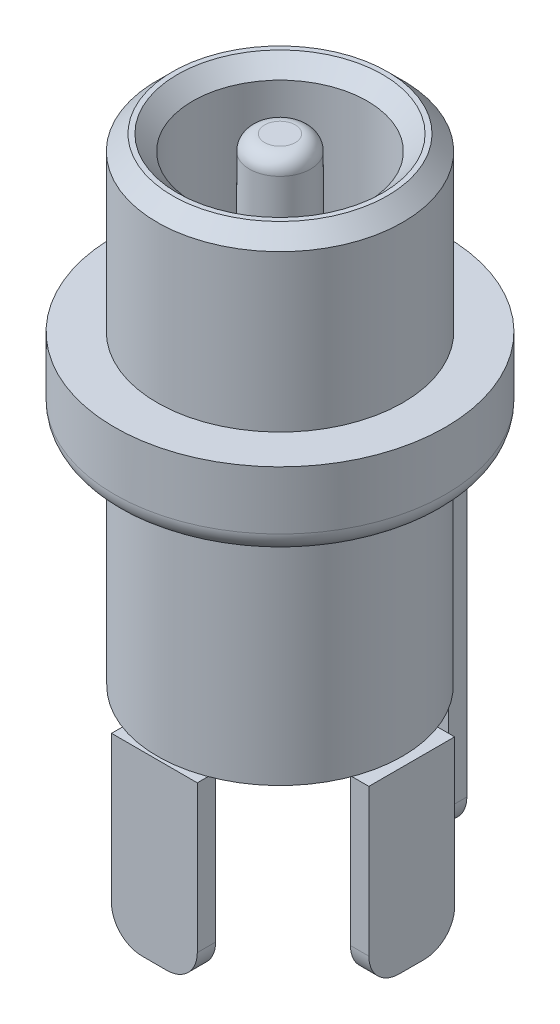
ISO-10303-21;
HEADER;
FILE_DESCRIPTION(('STEP AP214'),'2;1');
FILE_NAME('part.step','',(''),(''),'','','');
FILE_SCHEMA(('AUTOMOTIVE_DESIGN { 1 0 10303 214 1 1 1 1 }'));
ENDSEC;
DATA;
#1=APPLICATION_CONTEXT('core data for automotive mechanical design processes');
#2=APPLICATION_PROTOCOL_DEFINITION('international standard','automotive_design',2000,#1);
#3=PRODUCT_CONTEXT('',#1,'mechanical');
#4=PRODUCT('Part','Part','',(#3));
#5=PRODUCT_RELATED_PRODUCT_CATEGORY('part','',(#4));
#6=PRODUCT_DEFINITION_FORMATION('','',#4);
#7=PRODUCT_DEFINITION_CONTEXT('part definition',#1,'design');
#8=PRODUCT_DEFINITION('design','',#6,#7);
#9=PRODUCT_DEFINITION_SHAPE('','',#8);
#10=(LENGTH_UNIT() NAMED_UNIT(*) SI_UNIT(.MILLI.,.METRE.));
#11=(NAMED_UNIT(*) PLANE_ANGLE_UNIT() SI_UNIT($,.RADIAN.));
#12=(NAMED_UNIT(*) SI_UNIT($,.STERADIAN.) SOLID_ANGLE_UNIT());
#13=UNCERTAINTY_MEASURE_WITH_UNIT(LENGTH_MEASURE(1.E-05),#10,'distance_accuracy_value','');
#14=(GEOMETRIC_REPRESENTATION_CONTEXT(3) GLOBAL_UNCERTAINTY_ASSIGNED_CONTEXT((#13)) GLOBAL_UNIT_ASSIGNED_CONTEXT((#10,
#11,#12)) REPRESENTATION_CONTEXT('',''));
#15=CARTESIAN_POINT('',(0.,0.,0.));
#16=DIRECTION('',(0.,0.,1.));
#17=DIRECTION('',(1.,0.,0.));
#18=AXIS2_PLACEMENT_3D('',#15,#16,#17);
#19=CARTESIAN_POINT('',(4.3,-5.8,1.4));
#20=DIRECTION('',(-1.,0.,0.));
#21=DIRECTION('',(0.,-1.,0.));
#22=AXIS2_PLACEMENT_3D('',#19,#20,#21);
#23=PLANE('',#22);
#24=DIRECTION('',(0.,1.,0.));
#25=VECTOR('',#24,1.);
#26=CARTESIAN_POINT('',(4.3,-5.8,1.4));
#27=LINE('',#26,#25);
#28=CARTESIAN_POINT('',(4.3,-4.8,1.4));
#29=VERTEX_POINT('',#28);
#30=CARTESIAN_POINT('',(4.3,0.,1.4));
#31=VERTEX_POINT('',#30);
#32=EDGE_CURVE('E102',#29,#31,#27,.T.);
#33=ORIENTED_EDGE('',*,*,#32,.F.);
#34=CARTESIAN_POINT('',(4.3,-4.8,0.4));
#35=DIRECTION('',(-1.,0.,0.));
#36=DIRECTION('',(0.,-1.,0.));
#37=AXIS2_PLACEMENT_3D('',#34,#35,#36);
#38=CIRCLE('',#37,1.);
#39=CARTESIAN_POINT('',(4.3,-5.8,0.4));
#40=VERTEX_POINT('',#39);
#41=EDGE_CURVE('E59',#29,#40,#38,.F.);
#42=ORIENTED_EDGE('',*,*,#41,.T.);
#43=DIRECTION('',(0.,0.,1.));
#44=VECTOR('',#43,1.);
#45=CARTESIAN_POINT('',(4.3,-5.8,1.4));
#46=LINE('',#45,#44);
#47=CARTESIAN_POINT('',(4.3,-5.8,-0.4));
#48=VERTEX_POINT('',#47);
#49=EDGE_CURVE('E130',#48,#40,#46,.T.);
#50=ORIENTED_EDGE('',*,*,#49,.F.);
#51=CARTESIAN_POINT('',(4.3,-4.8,-0.4));
#52=DIRECTION('',(-1.,0.,0.));
#53=DIRECTION('',(0.,-1.,0.));
#54=AXIS2_PLACEMENT_3D('',#51,#52,#53);
#55=CIRCLE('',#54,1.);
#56=CARTESIAN_POINT('',(4.3,-4.8,-1.4));
#57=VERTEX_POINT('',#56);
#58=EDGE_CURVE('E66',#48,#57,#55,.F.);
#59=ORIENTED_EDGE('',*,*,#58,.T.);
#60=DIRECTION('',(0.,1.,0.));
#61=VECTOR('',#60,1.);
#62=CARTESIAN_POINT('',(4.3,-5.8,-1.4));
#63=LINE('',#62,#61);
#64=CARTESIAN_POINT('',(4.3,0.,-1.4));
#65=VERTEX_POINT('',#64);
#66=EDGE_CURVE('E120',#57,#65,#63,.T.);
#67=ORIENTED_EDGE('',*,*,#66,.T.);
#68=DIRECTION('',(0.,0.,1.));
#69=VECTOR('',#68,1.);
#70=CARTESIAN_POINT('',(4.3,0.,1.4));
#71=LINE('',#70,#69);
#72=EDGE_CURVE('E116',#65,#31,#71,.T.);
#73=ORIENTED_EDGE('',*,*,#72,.T.);
#74=EDGE_LOOP('',(#33,#42,#50,#59,#67,#73));
#75=FACE_BOUND('',#74,.T.);
#76=ADVANCED_FACE('F51',(#75),#23,.F.);
#77=CARTESIAN_POINT('',(3.7,-5.8,1.4));
#78=DIRECTION('',(0.,0.,-1.));
#79=DIRECTION('',(-1.,0.,0.));
#80=AXIS2_PLACEMENT_3D('',#77,#78,#79);
#81=PLANE('',#80);
#82=DIRECTION('',(0.,1.,0.));
#83=VECTOR('',#82,1.);
#84=CARTESIAN_POINT('',(3.7,-5.8,1.4));
#85=LINE('',#84,#83);
#86=CARTESIAN_POINT('',(3.7,-4.8,1.4));
#87=VERTEX_POINT('',#86);
#88=CARTESIAN_POINT('',(3.7,0.,1.4));
#89=VERTEX_POINT('',#88);
#90=EDGE_CURVE('E110',#87,#89,#85,.T.);
#91=ORIENTED_EDGE('',*,*,#90,.F.);
#92=DIRECTION('',(-1.,0.,0.));
#93=VECTOR('',#92,1.);
#94=CARTESIAN_POINT('',(4.3,-4.8,1.4));
#95=LINE('',#94,#93);
#96=EDGE_CURVE('E74',#87,#29,#95,.F.);
#97=ORIENTED_EDGE('',*,*,#96,.T.);
#98=ORIENTED_EDGE('',*,*,#32,.T.);
#99=DIRECTION('',(-1.,0.,0.));
#100=VECTOR('',#99,1.);
#101=CARTESIAN_POINT('',(3.7,0.,1.4));
#102=LINE('',#101,#100);
#103=EDGE_CURVE('E105',#31,#89,#102,.T.);
#104=ORIENTED_EDGE('',*,*,#103,.T.);
#105=EDGE_LOOP('',(#91,#97,#98,#104));
#106=FACE_BOUND('',#105,.T.);
#107=ADVANCED_FACE('F104',(#106),#81,.F.);
#108=CARTESIAN_POINT('',(3.7,-5.8,1.4));
#109=DIRECTION('',(1.,0.,0.));
#110=DIRECTION('',(0.,0.,-1.));
#111=AXIS2_PLACEMENT_3D('',#108,#109,#110);
#112=PLANE('',#111);
#113=DIRECTION('',(0.,0.,-1.));
#114=VECTOR('',#113,1.);
#115=CARTESIAN_POINT('',(3.7,-5.8,1.4));
#116=LINE('',#115,#114);
#117=CARTESIAN_POINT('',(3.7,-5.8,0.4));
#118=VERTEX_POINT('',#117);
#119=CARTESIAN_POINT('',(3.7,-5.8,-0.4));
#120=VERTEX_POINT('',#119);
#121=EDGE_CURVE('E124',#118,#120,#116,.T.);
#122=ORIENTED_EDGE('',*,*,#121,.F.);
#123=CARTESIAN_POINT('',(3.7,-4.8,0.4));
#124=DIRECTION('',(1.,0.,0.));
#125=DIRECTION('',(0.,0.,-1.));
#126=AXIS2_PLACEMENT_3D('',#123,#124,#125);
#127=CIRCLE('',#126,1.);
#128=EDGE_CURVE('E142',#118,#87,#127,.F.);
#129=ORIENTED_EDGE('',*,*,#128,.T.);
#130=ORIENTED_EDGE('',*,*,#90,.T.);
#131=DIRECTION('',(0.,0.,-1.));
#132=VECTOR('',#131,1.);
#133=CARTESIAN_POINT('',(3.7,0.,1.4));
#134=LINE('',#133,#132);
#135=CARTESIAN_POINT('',(3.7,0.,-1.4));
#136=VERTEX_POINT('',#135);
#137=EDGE_CURVE('E118',#89,#136,#134,.T.);
#138=ORIENTED_EDGE('',*,*,#137,.T.);
#139=DIRECTION('',(0.,1.,0.));
#140=VECTOR('',#139,1.);
#141=CARTESIAN_POINT('',(3.7,-5.8,-1.4));
#142=LINE('',#141,#140);
#143=CARTESIAN_POINT('',(3.7,-4.8,-1.4));
#144=VERTEX_POINT('',#143);
#145=EDGE_CURVE('E132',#144,#136,#142,.T.);
#146=ORIENTED_EDGE('',*,*,#145,.F.);
#147=CARTESIAN_POINT('',(3.7,-4.8,-0.4));
#148=DIRECTION('',(1.,0.,0.));
#149=DIRECTION('',(0.,0.,-1.));
#150=AXIS2_PLACEMENT_3D('',#147,#148,#149);
#151=CIRCLE('',#150,1.);
#152=EDGE_CURVE('E140',#144,#120,#151,.F.);
#153=ORIENTED_EDGE('',*,*,#152,.T.);
#154=EDGE_LOOP('',(#122,#129,#130,#138,#146,#153));
#155=FACE_BOUND('',#154,.T.);
#156=ADVANCED_FACE('F155',(#155),#112,.F.);
#157=CARTESIAN_POINT('',(3.7,-5.8,-1.4));
#158=DIRECTION('',(0.,0.,1.));
#159=DIRECTION('',(1.,0.,0.));
#160=AXIS2_PLACEMENT_3D('',#157,#158,#159);
#161=PLANE('',#160);
#162=ORIENTED_EDGE('',*,*,#66,.F.);
#163=DIRECTION('',(1.,0.,0.));
#164=VECTOR('',#163,1.);
#165=CARTESIAN_POINT('',(3.7,-4.8,-1.4));
#166=LINE('',#165,#164);
#167=EDGE_CURVE('E12',#57,#144,#166,.F.);
#168=ORIENTED_EDGE('',*,*,#167,.T.);
#169=ORIENTED_EDGE('',*,*,#145,.T.);
#170=DIRECTION('',(1.,0.,0.));
#171=VECTOR('',#170,1.);
#172=CARTESIAN_POINT('',(3.7,0.,-1.4));
#173=LINE('',#172,#171);
#174=EDGE_CURVE('E128',#136,#65,#173,.T.);
#175=ORIENTED_EDGE('',*,*,#174,.T.);
#176=EDGE_LOOP('',(#162,#168,#169,#175));
#177=FACE_BOUND('',#176,.T.);
#178=ADVANCED_FACE('F161',(#177),#161,.F.);
#179=CARTESIAN_POINT('',(0.,-5.8,0.));
#180=DIRECTION('',(0.,-1.,0.));
#181=DIRECTION('',(1.,0.,0.));
#182=AXIS2_PLACEMENT_3D('',#179,#180,#181);
#183=PLANE('',#182);
#184=ORIENTED_EDGE('',*,*,#49,.T.);
#185=DIRECTION('',(-1.,0.,0.));
#186=VECTOR('',#185,1.);
#187=CARTESIAN_POINT('',(3.7,-5.8,0.4));
#188=LINE('',#187,#186);
#189=EDGE_CURVE('E137',#40,#118,#188,.T.);
#190=ORIENTED_EDGE('',*,*,#189,.T.);
#191=ORIENTED_EDGE('',*,*,#121,.T.);
#192=DIRECTION('',(1.,0.,0.));
#193=VECTOR('',#192,1.);
#194=CARTESIAN_POINT('',(4.3,-5.8,-0.4));
#195=LINE('',#194,#193);
#196=EDGE_CURVE('E109',#120,#48,#195,.T.);
#197=ORIENTED_EDGE('',*,*,#196,.T.);
#198=EDGE_LOOP('',(#184,#190,#191,#197));
#199=FACE_BOUND('',#198,.T.);
#200=ADVANCED_FACE('F149',(#199),#183,.T.);
#201=CARTESIAN_POINT('',(0.,0.,0.));
#202=DIRECTION('',(0.,-1.,0.));
#203=DIRECTION('',(1.,0.,0.));
#204=AXIS2_PLACEMENT_3D('',#201,#202,#203);
#205=PLANE('',#204);
#206=ORIENTED_EDGE('',*,*,#72,.F.);
#207=ORIENTED_EDGE('',*,*,#174,.F.);
#208=ORIENTED_EDGE('',*,*,#137,.F.);
#209=ORIENTED_EDGE('',*,*,#103,.F.);
#210=EDGE_LOOP('',(#206,#207,#208,#209));
#211=FACE_BOUND('',#210,.T.);
#212=ADVANCED_FACE('F114',(#211),#205,.F.);
#213=CARTESIAN_POINT('',(0.,-4.8,0.399999999999999));
#214=DIRECTION('',(1.,0.,0.));
#215=DIRECTION('',(0.,0.,-1.));
#216=AXIS2_PLACEMENT_3D('',#213,#214,#215);
#217=CYLINDRICAL_SURFACE('',#216,1.);
#218=ORIENTED_EDGE('',*,*,#41,.F.);
#219=ORIENTED_EDGE('',*,*,#96,.F.);
#220=ORIENTED_EDGE('',*,*,#128,.F.);
#221=ORIENTED_EDGE('',*,*,#189,.F.);
#222=EDGE_LOOP('',(#218,#219,#220,#221));
#223=FACE_BOUND('',#222,.T.);
#224=ADVANCED_FACE('F153',(#223),#217,.T.);
#225=CARTESIAN_POINT('',(0.,-4.8,-0.4));
#226=DIRECTION('',(-1.,0.,0.));
#227=DIRECTION('',(0.,-1.,0.));
#228=AXIS2_PLACEMENT_3D('',#225,#226,#227);
#229=CYLINDRICAL_SURFACE('',#228,1.);
#230=ORIENTED_EDGE('',*,*,#152,.F.);
#231=ORIENTED_EDGE('',*,*,#167,.F.);
#232=ORIENTED_EDGE('',*,*,#58,.F.);
#233=ORIENTED_EDGE('',*,*,#196,.F.);
#234=EDGE_LOOP('',(#230,#231,#232,#233));
#235=FACE_BOUND('',#234,.T.);
#236=ADVANCED_FACE('F53',(#235),#229,.T.);
#237=CLOSED_SHELL('',(#76,#107,#156,#178,#200,#212,#224,#236));
#238=MANIFOLD_SOLID_BREP('B2',#237);
#239=CARTESIAN_POINT('',(1.4,-5.8,4.1));
#240=DIRECTION('',(-1.,0.,0.));
#241=DIRECTION('',(0.,-1.,0.));
#242=AXIS2_PLACEMENT_3D('',#239,#240,#241);
#243=PLANE('',#242);
#244=DIRECTION('',(0.,1.,0.));
#245=VECTOR('',#244,1.);
#246=CARTESIAN_POINT('',(1.4,-5.8,4.1));
#247=LINE('',#246,#245);
#248=CARTESIAN_POINT('',(1.4,-4.8,4.1));
#249=VERTEX_POINT('',#248);
#250=CARTESIAN_POINT('',(1.4,0.,4.1));
#251=VERTEX_POINT('',#250);
#252=EDGE_CURVE('E285',#249,#251,#247,.T.);
#253=ORIENTED_EDGE('',*,*,#252,.F.);
#254=DIRECTION('',(0.,0.,1.));
#255=VECTOR('',#254,1.);
#256=CARTESIAN_POINT('',(1.4,-4.8,3.5));
#257=LINE('',#256,#255);
#258=CARTESIAN_POINT('',(1.4,-4.8,3.5));
#259=VERTEX_POINT('',#258);
#260=EDGE_CURVE('E49',#249,#259,#257,.F.);
#261=ORIENTED_EDGE('',*,*,#260,.T.);
#262=DIRECTION('',(0.,1.,0.));
#263=VECTOR('',#262,1.);
#264=CARTESIAN_POINT('',(1.4,-5.8,3.5));
#265=LINE('',#264,#263);
#266=CARTESIAN_POINT('',(1.4,0.,3.5));
#267=VERTEX_POINT('',#266);
#268=EDGE_CURVE('E305',#259,#267,#265,.T.);
#269=ORIENTED_EDGE('',*,*,#268,.T.);
#270=DIRECTION('',(0.,0.,1.));
#271=VECTOR('',#270,1.);
#272=CARTESIAN_POINT('',(1.4,0.,4.1));
#273=LINE('',#272,#271);
#274=EDGE_CURVE('E300',#267,#251,#273,.T.);
#275=ORIENTED_EDGE('',*,*,#274,.T.);
#276=EDGE_LOOP('',(#253,#261,#269,#275));
#277=FACE_BOUND('',#276,.T.);
#278=ADVANCED_FACE('F234',(#277),#243,.F.);
#279=CARTESIAN_POINT('',(-1.4,-5.8,4.1));
#280=DIRECTION('',(0.,0.,-1.));
#281=DIRECTION('',(-1.,0.,0.));
#282=AXIS2_PLACEMENT_3D('',#279,#280,#281);
#283=PLANE('',#282);
#284=DIRECTION('',(0.,1.,0.));
#285=VECTOR('',#284,1.);
#286=CARTESIAN_POINT('',(-1.4,-5.8,4.1));
#287=LINE('',#286,#285);
#288=CARTESIAN_POINT('',(-1.4,-4.8,4.1));
#289=VERTEX_POINT('',#288);
#290=CARTESIAN_POINT('',(-1.4,0.,4.1));
#291=VERTEX_POINT('',#290);
#292=EDGE_CURVE('E294',#289,#291,#287,.T.);
#293=ORIENTED_EDGE('',*,*,#292,.F.);
#294=CARTESIAN_POINT('',(-0.4,-4.8,4.1));
#295=DIRECTION('',(0.,0.,-1.));
#296=DIRECTION('',(-1.,0.,0.));
#297=AXIS2_PLACEMENT_3D('',#294,#295,#296);
#298=CIRCLE('',#297,1.);
#299=CARTESIAN_POINT('',(-0.4,-5.8,4.1));
#300=VERTEX_POINT('',#299);
#301=EDGE_CURVE('E242',#289,#300,#298,.F.);
#302=ORIENTED_EDGE('',*,*,#301,.T.);
#303=DIRECTION('',(-1.,0.,0.));
#304=VECTOR('',#303,1.);
#305=CARTESIAN_POINT('',(-1.4,-5.8,4.1));
#306=LINE('',#305,#304);
#307=CARTESIAN_POINT('',(0.4,-5.8,4.1));
#308=VERTEX_POINT('',#307);
#309=EDGE_CURVE('E315',#308,#300,#306,.T.);
#310=ORIENTED_EDGE('',*,*,#309,.F.);
#311=CARTESIAN_POINT('',(0.4,-4.8,4.1));
#312=DIRECTION('',(0.,0.,-1.));
#313=DIRECTION('',(-1.,0.,0.));
#314=AXIS2_PLACEMENT_3D('',#311,#312,#313);
#315=CIRCLE('',#314,1.);
#316=EDGE_CURVE('E249',#308,#249,#315,.F.);
#317=ORIENTED_EDGE('',*,*,#316,.T.);
#318=ORIENTED_EDGE('',*,*,#252,.T.);
#319=DIRECTION('',(-1.,0.,0.));
#320=VECTOR('',#319,1.);
#321=CARTESIAN_POINT('',(-1.4,0.,4.1));
#322=LINE('',#321,#320);
#323=EDGE_CURVE('E288',#251,#291,#322,.T.);
#324=ORIENTED_EDGE('',*,*,#323,.T.);
#325=EDGE_LOOP('',(#293,#302,#310,#317,#318,#324));
#326=FACE_BOUND('',#325,.T.);
#327=ADVANCED_FACE('F287',(#326),#283,.F.);
#328=CARTESIAN_POINT('',(-1.4,-5.8,4.1));
#329=DIRECTION('',(1.,0.,0.));
#330=DIRECTION('',(0.,1.,0.));
#331=AXIS2_PLACEMENT_3D('',#328,#329,#330);
#332=PLANE('',#331);
#333=DIRECTION('',(0.,1.,0.));
#334=VECTOR('',#333,1.);
#335=CARTESIAN_POINT('',(-1.4,-5.8,3.5));
#336=LINE('',#335,#334);
#337=CARTESIAN_POINT('',(-1.4,-4.8,3.5));
#338=VERTEX_POINT('',#337);
#339=CARTESIAN_POINT('',(-1.4,0.,3.5));
#340=VERTEX_POINT('',#339);
#341=EDGE_CURVE('E317',#338,#340,#336,.T.);
#342=ORIENTED_EDGE('',*,*,#341,.F.);
#343=DIRECTION('',(0.,0.,-1.));
#344=VECTOR('',#343,1.);
#345=CARTESIAN_POINT('',(-1.4,-4.8,4.1));
#346=LINE('',#345,#344);
#347=EDGE_CURVE('E257',#338,#289,#346,.F.);
#348=ORIENTED_EDGE('',*,*,#347,.T.);
#349=ORIENTED_EDGE('',*,*,#292,.T.);
#350=DIRECTION('',(0.,0.,-1.));
#351=VECTOR('',#350,1.);
#352=CARTESIAN_POINT('',(-1.4,0.,4.1));
#353=LINE('',#352,#351);
#354=EDGE_CURVE('E302',#291,#340,#353,.T.);
#355=ORIENTED_EDGE('',*,*,#354,.T.);
#356=EDGE_LOOP('',(#342,#348,#349,#355));
#357=FACE_BOUND('',#356,.T.);
#358=ADVANCED_FACE('F342',(#357),#332,.F.);
#359=CARTESIAN_POINT('',(-1.4,-5.8,3.5));
#360=DIRECTION('',(0.,0.,1.));
#361=DIRECTION('',(1.,0.,0.));
#362=AXIS2_PLACEMENT_3D('',#359,#360,#361);
#363=PLANE('',#362);
#364=DIRECTION('',(1.,0.,0.));
#365=VECTOR('',#364,1.);
#366=CARTESIAN_POINT('',(-1.4,-5.8,3.5));
#367=LINE('',#366,#365);
#368=CARTESIAN_POINT('',(-0.4,-5.8,3.5));
#369=VERTEX_POINT('',#368);
#370=CARTESIAN_POINT('',(0.4,-5.8,3.5));
#371=VERTEX_POINT('',#370);
#372=EDGE_CURVE('E309',#369,#371,#367,.T.);
#373=ORIENTED_EDGE('',*,*,#372,.F.);
#374=CARTESIAN_POINT('',(-0.4,-4.8,3.5));
#375=DIRECTION('',(0.,0.,1.));
#376=DIRECTION('',(1.,0.,0.));
#377=AXIS2_PLACEMENT_3D('',#374,#375,#376);
#378=CIRCLE('',#377,1.);
#379=EDGE_CURVE('E327',#369,#338,#378,.F.);
#380=ORIENTED_EDGE('',*,*,#379,.T.);
#381=ORIENTED_EDGE('',*,*,#341,.T.);
#382=DIRECTION('',(1.,0.,0.));
#383=VECTOR('',#382,1.);
#384=CARTESIAN_POINT('',(-1.4,0.,3.5));
#385=LINE('',#384,#383);
#386=EDGE_CURVE('E313',#340,#267,#385,.T.);
#387=ORIENTED_EDGE('',*,*,#386,.T.);
#388=ORIENTED_EDGE('',*,*,#268,.F.);
#389=CARTESIAN_POINT('',(0.4,-4.8,3.5));
#390=DIRECTION('',(0.,0.,1.));
#391=DIRECTION('',(1.,0.,0.));
#392=AXIS2_PLACEMENT_3D('',#389,#390,#391);
#393=CIRCLE('',#392,1.);
#394=EDGE_CURVE('E325',#259,#371,#393,.F.);
#395=ORIENTED_EDGE('',*,*,#394,.T.);
#396=EDGE_LOOP('',(#373,#380,#381,#387,#388,#395));
#397=FACE_BOUND('',#396,.T.);
#398=ADVANCED_FACE('F341',(#397),#363,.F.);
#399=CARTESIAN_POINT('',(0.,-5.8,0.));
#400=DIRECTION('',(0.,-1.,0.));
#401=DIRECTION('',(1.,0.,0.));
#402=AXIS2_PLACEMENT_3D('',#399,#400,#401);
#403=PLANE('',#402);
#404=ORIENTED_EDGE('',*,*,#309,.T.);
#405=DIRECTION('',(0.,0.,-1.));
#406=VECTOR('',#405,1.);
#407=CARTESIAN_POINT('',(-0.4,-5.8,3.5));
#408=LINE('',#407,#406);
#409=EDGE_CURVE('E322',#300,#369,#408,.T.);
#410=ORIENTED_EDGE('',*,*,#409,.T.);
#411=ORIENTED_EDGE('',*,*,#372,.T.);
#412=DIRECTION('',(0.,0.,1.));
#413=VECTOR('',#412,1.);
#414=CARTESIAN_POINT('',(0.4,-5.8,4.1));
#415=LINE('',#414,#413);
#416=EDGE_CURVE('E293',#371,#308,#415,.T.);
#417=ORIENTED_EDGE('',*,*,#416,.T.);
#418=EDGE_LOOP('',(#404,#410,#411,#417));
#419=FACE_BOUND('',#418,.T.);
#420=ADVANCED_FACE('F335',(#419),#403,.T.);
#421=CARTESIAN_POINT('',(0.,0.,0.));
#422=DIRECTION('',(0.,-1.,0.));
#423=DIRECTION('',(1.,0.,0.));
#424=AXIS2_PLACEMENT_3D('',#421,#422,#423);
#425=PLANE('',#424);
#426=ORIENTED_EDGE('',*,*,#274,.F.);
#427=ORIENTED_EDGE('',*,*,#386,.F.);
#428=ORIENTED_EDGE('',*,*,#354,.F.);
#429=ORIENTED_EDGE('',*,*,#323,.F.);
#430=EDGE_LOOP('',(#426,#427,#428,#429));
#431=FACE_BOUND('',#430,.T.);
#432=ADVANCED_FACE('F298',(#431),#425,.F.);
#433=CARTESIAN_POINT('',(-0.4,-4.8,0.));
#434=DIRECTION('',(0.,0.,1.));
#435=DIRECTION('',(1.,0.,0.));
#436=AXIS2_PLACEMENT_3D('',#433,#434,#435);
#437=CYLINDRICAL_SURFACE('',#436,1.);
#438=ORIENTED_EDGE('',*,*,#301,.F.);
#439=ORIENTED_EDGE('',*,*,#347,.F.);
#440=ORIENTED_EDGE('',*,*,#379,.F.);
#441=ORIENTED_EDGE('',*,*,#409,.F.);
#442=EDGE_LOOP('',(#438,#439,#440,#441));
#443=FACE_BOUND('',#442,.T.);
#444=ADVANCED_FACE('F339',(#443),#437,.T.);
#445=CARTESIAN_POINT('',(0.4,-4.8,0.));
#446=DIRECTION('',(0.,0.,-1.));
#447=DIRECTION('',(-1.,0.,0.));
#448=AXIS2_PLACEMENT_3D('',#445,#446,#447);
#449=CYLINDRICAL_SURFACE('',#448,1.);
#450=ORIENTED_EDGE('',*,*,#394,.F.);
#451=ORIENTED_EDGE('',*,*,#260,.F.);
#452=ORIENTED_EDGE('',*,*,#316,.F.);
#453=ORIENTED_EDGE('',*,*,#416,.F.);
#454=EDGE_LOOP('',(#450,#451,#452,#453));
#455=FACE_BOUND('',#454,.T.);
#456=ADVANCED_FACE('F236',(#455),#449,.T.);
#457=CLOSED_SHELL('',(#278,#327,#358,#398,#420,#432,#444,#456));
#458=MANIFOLD_SOLID_BREP('B6',#457);
#459=CARTESIAN_POINT('',(0.,7.4,0.));
#460=DIRECTION('',(0.,1.,0.));
#461=DIRECTION('',(-1.,0.,0.));
#462=AXIS2_PLACEMENT_3D('',#459,#460,#461);
#463=PLANE('',#462);
#464=CARTESIAN_POINT('',(0.,7.4,0.));
#465=DIRECTION('',(0.,-1.,0.));
#466=DIRECTION('',(1.,0.,0.));
#467=AXIS2_PLACEMENT_3D('',#464,#465,#466);
#468=CIRCLE('',#467,4.);
#469=CARTESIAN_POINT('',(4.,7.4,0.));
#470=VERTEX_POINT('',#469);
#471=EDGE_CURVE('E233',#470,#470,#468,.T.);
#472=ORIENTED_EDGE('',*,*,#471,.F.);
#473=EDGE_LOOP('',(#472));
#474=FACE_BOUND('',#473,.T.);
#475=ADVANCED_FACE('F418',(#474),#463,.T.);
#476=CARTESIAN_POINT('',(0.,0.,0.));
#477=DIRECTION('',(0.,-1.,0.));
#478=DIRECTION('',(1.,0.,0.));
#479=AXIS2_PLACEMENT_3D('',#476,#477,#478);
#480=CYLINDRICAL_SURFACE('',#479,4.);
#481=CARTESIAN_POINT('',(0.,0.,0.));
#482=DIRECTION('',(0.,-1.,0.));
#483=DIRECTION('',(1.,0.,0.));
#484=AXIS2_PLACEMENT_3D('',#481,#482,#483);
#485=CIRCLE('',#484,4.);
#486=CARTESIAN_POINT('',(4.,0.,0.));
#487=VERTEX_POINT('',#486);
#488=EDGE_CURVE('E424',#487,#487,#485,.T.);
#489=ORIENTED_EDGE('',*,*,#488,.F.);
#490=EDGE_LOOP('',(#489));
#491=FACE_BOUND('',#490,.T.);
#492=ORIENTED_EDGE('',*,*,#471,.T.);
#493=EDGE_LOOP('',(#492));
#494=FACE_BOUND('',#493,.T.);
#495=ADVANCED_FACE('F432',(#491,#494),#480,.T.);
#496=CARTESIAN_POINT('',(0.,0.,0.));
#497=DIRECTION('',(0.,1.,0.));
#498=DIRECTION('',(-1.,0.,0.));
#499=AXIS2_PLACEMENT_3D('',#496,#497,#498);
#500=PLANE('',#499);
#501=ORIENTED_EDGE('',*,*,#488,.T.);
#502=EDGE_LOOP('',(#501));
#503=FACE_BOUND('',#502,.T.);
#504=ADVANCED_FACE('F430',(#503),#500,.F.);
#505=CLOSED_SHELL('',(#475,#495,#504));
#506=MANIFOLD_SOLID_BREP('B43',#505);
#507=CARTESIAN_POINT('',(0.,7.4,0.));
#508=DIRECTION('',(0.,1.,0.));
#509=DIRECTION('',(-1.,0.,0.));
#510=AXIS2_PLACEMENT_3D('',#507,#508,#509);
#511=PLANE('',#510);
#512=DIRECTION('',(0.,0.,-1.));
#513=VECTOR('',#512,1.);
#514=CARTESIAN_POINT('',(1.4,7.4,0.));
#515=LINE('',#514,#513);
#516=CARTESIAN_POINT('',(1.4,7.4,-4.1));
#517=VERTEX_POINT('',#516);
#518=CARTESIAN_POINT('',(1.4,7.4,-4.48664685483491));
#519=VERTEX_POINT('',#518);
#520=EDGE_CURVE('E543',#517,#519,#515,.T.);
#521=ORIENTED_EDGE('',*,*,#520,.T.);
#522=CARTESIAN_POINT('',(0.,7.4,0.));
#523=DIRECTION('',(0.,1.,0.));
#524=DIRECTION('',(-1.,0.,0.));
#525=AXIS2_PLACEMENT_3D('',#522,#523,#524);
#526=CIRCLE('',#525,4.7);
#527=CARTESIAN_POINT('',(-1.4,7.4,-4.48664685483491));
#528=VERTEX_POINT('',#527);
#529=EDGE_CURVE('E572',#519,#528,#526,.F.);
#530=ORIENTED_EDGE('',*,*,#529,.T.);
#531=DIRECTION('',(0.,0.,-1.));
#532=VECTOR('',#531,1.);
#533=CARTESIAN_POINT('',(-1.4,7.4,0.));
#534=LINE('',#533,#532);
#535=CARTESIAN_POINT('',(-1.4,7.4,-4.1));
#536=VERTEX_POINT('',#535);
#537=EDGE_CURVE('E550',#536,#528,#534,.T.);
#538=ORIENTED_EDGE('',*,*,#537,.F.);
#539=DIRECTION('',(1.,0.,0.));
#540=VECTOR('',#539,1.);
#541=CARTESIAN_POINT('',(0.,7.4,-4.1));
#542=LINE('',#541,#540);
#543=EDGE_CURVE('E544',#536,#517,#542,.T.);
#544=ORIENTED_EDGE('',*,*,#543,.T.);
#545=EDGE_LOOP('',(#521,#530,#538,#544));
#546=FACE_BOUND('',#545,.T.);
#547=ADVANCED_FACE('F458',(#546),#511,.F.);
#548=CARTESIAN_POINT('',(0.,15.6,0.));
#549=DIRECTION('',(0.,-1.,0.));
#550=DIRECTION('',(1.,0.,0.));
#551=AXIS2_PLACEMENT_3D('',#548,#549,#550);
#552=PLANE('',#551);
#553=CARTESIAN_POINT('',(0.,15.6,0.));
#554=DIRECTION('',(0.,-1.,0.));
#555=DIRECTION('',(1.,0.,0.));
#556=AXIS2_PLACEMENT_3D('',#553,#554,#555);
#557=CIRCLE('',#556,3.51);
#558=CARTESIAN_POINT('',(3.51,15.6,0.));
#559=VERTEX_POINT('',#558);
#560=EDGE_CURVE('E591',#559,#559,#557,.F.);
#561=ORIENTED_EDGE('',*,*,#560,.T.);
#562=EDGE_LOOP('',(#561));
#563=FACE_BOUND('',#562,.T.);
#564=CARTESIAN_POINT('',(0.,15.6,0.));
#565=DIRECTION('',(0.,-1.,0.));
#566=DIRECTION('',(1.,0.,0.));
#567=AXIS2_PLACEMENT_3D('',#564,#565,#566);
#568=CIRCLE('',#567,3.35);
#569=CARTESIAN_POINT('',(3.35,15.6,0.));
#570=VERTEX_POINT('',#569);
#571=EDGE_CURVE('E588',#570,#570,#568,.T.);
#572=ORIENTED_EDGE('',*,*,#571,.T.);
#573=EDGE_LOOP('',(#572));
#574=FACE_BOUND('',#573,.T.);
#575=ADVANCED_FACE('F638',(#563,#574),#552,.F.);
#576=CARTESIAN_POINT('',(0.,0.,0.));
#577=DIRECTION('',(0.,-1.,0.));
#578=DIRECTION('',(1.,0.,0.));
#579=AXIS2_PLACEMENT_3D('',#576,#577,#578);
#580=CYLINDRICAL_SURFACE('',#579,4.01);
#581=CARTESIAN_POINT('',(0.,15.1,0.));
#582=DIRECTION('',(0.,-1.,0.));
#583=DIRECTION('',(1.,0.,0.));
#584=AXIS2_PLACEMENT_3D('',#581,#582,#583);
#585=CIRCLE('',#584,4.01);
#586=CARTESIAN_POINT('',(4.01,15.1,0.));
#587=VERTEX_POINT('',#586);
#588=EDGE_CURVE('E585',#587,#587,#585,.T.);
#589=ORIENTED_EDGE('',*,*,#588,.T.);
#590=EDGE_LOOP('',(#589));
#591=FACE_BOUND('',#590,.T.);
#592=CARTESIAN_POINT('',(0.,10.,0.));
#593=DIRECTION('',(0.,-1.,0.));
#594=DIRECTION('',(1.,0.,0.));
#595=AXIS2_PLACEMENT_3D('',#592,#593,#594);
#596=CIRCLE('',#595,4.01);
#597=CARTESIAN_POINT('',(4.01,10.,0.));
#598=VERTEX_POINT('',#597);
#599=EDGE_CURVE('E569',#598,#598,#596,.T.);
#600=ORIENTED_EDGE('',*,*,#599,.F.);
#601=EDGE_LOOP('',(#600));
#602=FACE_BOUND('',#601,.T.);
#603=ADVANCED_FACE('F643',(#591,#602),#580,.T.);
#604=CARTESIAN_POINT('',(0.,10.,0.));
#605=DIRECTION('',(0.,-1.,0.));
#606=DIRECTION('',(1.,0.,0.));
#607=AXIS2_PLACEMENT_3D('',#604,#605,#606);
#608=PLANE('',#607);
#609=CARTESIAN_POINT('',(0.,10.,0.));
#610=DIRECTION('',(0.,-1.,0.));
#611=DIRECTION('',(1.,0.,0.));
#612=AXIS2_PLACEMENT_3D('',#609,#610,#611);
#613=CIRCLE('',#612,5.4);
#614=CARTESIAN_POINT('',(5.4,10.,0.));
#615=VERTEX_POINT('',#614);
#616=EDGE_CURVE('E566',#615,#615,#613,.T.);
#617=ORIENTED_EDGE('',*,*,#616,.F.);
#618=EDGE_LOOP('',(#617));
#619=FACE_BOUND('',#618,.T.);
#620=ORIENTED_EDGE('',*,*,#599,.T.);
#621=EDGE_LOOP('',(#620));
#622=FACE_BOUND('',#621,.T.);
#623=ADVANCED_FACE('F698',(#619,#622),#608,.F.);
#624=CARTESIAN_POINT('',(0.,0.,0.));
#625=DIRECTION('',(0.,-1.,0.));
#626=DIRECTION('',(1.,0.,0.));
#627=AXIS2_PLACEMENT_3D('',#624,#625,#626);
#628=CYLINDRICAL_SURFACE('',#627,5.4);
#629=CARTESIAN_POINT('',(0.,8.1,0.));
#630=DIRECTION('',(0.,1.,0.));
#631=DIRECTION('',(-1.,0.,0.));
#632=AXIS2_PLACEMENT_3D('',#629,#630,#631);
#633=CIRCLE('',#632,5.4);
#634=CARTESIAN_POINT('',(-5.4,8.1,0.));
#635=VERTEX_POINT('',#634);
#636=EDGE_CURVE('E576',#635,#635,#633,.T.);
#637=ORIENTED_EDGE('',*,*,#636,.T.);
#638=EDGE_LOOP('',(#637));
#639=FACE_BOUND('',#638,.T.);
#640=ORIENTED_EDGE('',*,*,#616,.T.);
#641=EDGE_LOOP('',(#640));
#642=FACE_BOUND('',#641,.T.);
#643=ADVANCED_FACE('F652',(#639,#642),#628,.T.);
#644=CARTESIAN_POINT('',(0.,8.1,0.));
#645=DIRECTION('',(0.,1.,0.));
#646=DIRECTION('',(-1.,0.,0.));
#647=AXIS2_PLACEMENT_3D('',#644,#645,#646);
#648=TOROIDAL_SURFACE('',#647,4.7,0.7);
#649=ORIENTED_EDGE('',*,*,#636,.F.);
#650=EDGE_LOOP('',(#649));
#651=FACE_BOUND('',#650,.T.);
#652=CARTESIAN_POINT('',(0.,7.4,-4.7));
#653=VERTEX_POINT('',#652);
#654=EDGE_CURVE('E573',#528,#653,#526,.F.);
#655=ORIENTED_EDGE('',*,*,#654,.F.);
#656=ORIENTED_EDGE('',*,*,#529,.F.);
#657=EDGE_CURVE('E540',#653,#519,#526,.F.);
#658=ORIENTED_EDGE('',*,*,#657,.F.);
#659=EDGE_LOOP('',(#655,#656,#658));
#660=FACE_BOUND('',#659,.T.);
#661=ADVANCED_FACE('F628',(#651,#660),#648,.T.);
#662=CARTESIAN_POINT('',(0.,10.,0.));
#663=DIRECTION('',(0.,1.,0.));
#664=DIRECTION('',(-1.,0.,0.));
#665=AXIS2_PLACEMENT_3D('',#662,#663,#664);
#666=CYLINDRICAL_SURFACE('',#665,2.85);
#667=CARTESIAN_POINT('',(0.,15.1,0.));
#668=DIRECTION('',(0.,-1.,0.));
#669=DIRECTION('',(1.,0.,0.));
#670=AXIS2_PLACEMENT_3D('',#667,#668,#669);
#671=CIRCLE('',#670,2.85);
#672=CARTESIAN_POINT('',(2.85,15.1,0.));
#673=VERTEX_POINT('',#672);
#674=EDGE_CURVE('E594',#673,#673,#671,.F.);
#675=ORIENTED_EDGE('',*,*,#674,.T.);
#676=EDGE_LOOP('',(#675));
#677=FACE_BOUND('',#676,.T.);
#678=CARTESIAN_POINT('',(0.,10.,0.));
#679=DIRECTION('',(0.,1.,0.));
#680=DIRECTION('',(-1.,0.,0.));
#681=AXIS2_PLACEMENT_3D('',#678,#679,#680);
#682=CIRCLE('',#681,2.85);
#683=CARTESIAN_POINT('',(-2.85,10.,0.));
#684=VERTEX_POINT('',#683);
#685=EDGE_CURVE('E563',#684,#684,#682,.T.);
#686=ORIENTED_EDGE('',*,*,#685,.F.);
#687=EDGE_LOOP('',(#686));
#688=FACE_BOUND('',#687,.T.);
#689=ADVANCED_FACE('F651',(#677,#688),#666,.F.);
#690=CARTESIAN_POINT('',(0.,10.,0.));
#691=DIRECTION('',(0.,1.,0.));
#692=DIRECTION('',(-1.,0.,0.));
#693=AXIS2_PLACEMENT_3D('',#690,#691,#692);
#694=PLANE('',#693);
#695=CARTESIAN_POINT('',(0.,10.,0.));
#696=DIRECTION('',(0.,1.,0.));
#697=DIRECTION('',(-1.,0.,0.));
#698=AXIS2_PLACEMENT_3D('',#695,#696,#697);
#699=CIRCLE('',#698,1.);
#700=CARTESIAN_POINT('',(-1.,10.,0.));
#701=VERTEX_POINT('',#700);
#702=EDGE_CURVE('E560',#701,#701,#699,.T.);
#703=ORIENTED_EDGE('',*,*,#702,.F.);
#704=EDGE_LOOP('',(#703));
#705=FACE_BOUND('',#704,.T.);
#706=ORIENTED_EDGE('',*,*,#685,.T.);
#707=EDGE_LOOP('',(#706));
#708=FACE_BOUND('',#707,.T.);
#709=ADVANCED_FACE('F681',(#705,#708),#694,.T.);
#710=CARTESIAN_POINT('',(0.,10.,0.));
#711=DIRECTION('',(0.,1.,0.));
#712=DIRECTION('',(-1.,0.,0.));
#713=AXIS2_PLACEMENT_3D('',#710,#711,#712);
#714=CYLINDRICAL_SURFACE('',#713,1.);
#715=CARTESIAN_POINT('',(0.,15.1,0.));
#716=DIRECTION('',(0.,-1.,0.));
#717=DIRECTION('',(1.,0.,0.));
#718=AXIS2_PLACEMENT_3D('',#715,#716,#717);
#719=CIRCLE('',#718,1.);
#720=CARTESIAN_POINT('',(1.,15.1,0.));
#721=VERTEX_POINT('',#720);
#722=EDGE_CURVE('E582',#721,#721,#719,.T.);
#723=ORIENTED_EDGE('',*,*,#722,.T.);
#724=EDGE_LOOP('',(#723));
#725=FACE_BOUND('',#724,.T.);
#726=ORIENTED_EDGE('',*,*,#702,.T.);
#727=EDGE_LOOP('',(#726));
#728=FACE_BOUND('',#727,.T.);
#729=ADVANCED_FACE('F686',(#725,#728),#714,.T.);
#730=CARTESIAN_POINT('',(0.,15.6,0.));
#731=DIRECTION('',(0.,-1.,0.));
#732=DIRECTION('',(1.,0.,0.));
#733=AXIS2_PLACEMENT_3D('',#730,#731,#732);
#734=CIRCLE('',#733,0.5);
#735=CARTESIAN_POINT('',(0.5,15.6,0.));
#736=VERTEX_POINT('',#735);
#737=EDGE_CURVE('E579',#736,#736,#734,.F.);
#738=ORIENTED_EDGE('',*,*,#737,.T.);
#739=EDGE_LOOP('',(#738));
#740=FACE_BOUND('',#739,.T.);
#741=ADVANCED_FACE('F646',(#740),#552,.F.);
#742=CARTESIAN_POINT('',(0.,15.1,0.));
#743=DIRECTION('',(0.,-1.,0.));
#744=DIRECTION('',(1.,0.,0.));
#745=AXIS2_PLACEMENT_3D('',#742,#743,#744);
#746=DEGENERATE_TOROIDAL_SURFACE('',#745,0.5,0.5,.T.);
#747=ORIENTED_EDGE('',*,*,#722,.F.);
#748=EDGE_LOOP('',(#747));
#749=FACE_BOUND('',#748,.T.);
#750=ORIENTED_EDGE('',*,*,#737,.F.);
#751=EDGE_LOOP('',(#750));
#752=FACE_BOUND('',#751,.T.);
#753=ADVANCED_FACE('F654',(#749,#752),#746,.T.);
#754=CARTESIAN_POINT('',(0.,15.1,0.));
#755=DIRECTION('',(0.,-1.,0.));
#756=DIRECTION('',(1.,0.,0.));
#757=AXIS2_PLACEMENT_3D('',#754,#755,#756);
#758=CONICAL_SURFACE('',#757,4.01,0.785398163397448);
#759=ORIENTED_EDGE('',*,*,#560,.F.);
#760=EDGE_LOOP('',(#759));
#761=FACE_BOUND('',#760,.T.);
#762=ORIENTED_EDGE('',*,*,#588,.F.);
#763=EDGE_LOOP('',(#762));
#764=FACE_BOUND('',#763,.T.);
#765=ADVANCED_FACE('F657',(#761,#764),#758,.T.);
#766=CARTESIAN_POINT('',(0.,15.1,0.));
#767=DIRECTION('',(0.,1.,0.));
#768=DIRECTION('',(-1.,0.,0.));
#769=AXIS2_PLACEMENT_3D('',#766,#767,#768);
#770=CONICAL_SURFACE('',#769,2.85,0.78539816339745);
#771=ORIENTED_EDGE('',*,*,#571,.F.);
#772=EDGE_LOOP('',(#771));
#773=FACE_BOUND('',#772,.T.);
#774=ORIENTED_EDGE('',*,*,#674,.F.);
#775=EDGE_LOOP('',(#774));
#776=FACE_BOUND('',#775,.T.);
#777=ADVANCED_FACE('F665',(#773,#776),#770,.F.);
#778=CARTESIAN_POINT('',(0.,7.4,0.));
#779=DIRECTION('',(0.,1.,0.));
#780=DIRECTION('',(-1.,0.,0.));
#781=AXIS2_PLACEMENT_3D('',#778,#779,#780);
#782=PLANE('',#781);
#783=CARTESIAN_POINT('',(-1.4,7.4,-4.7));
#784=VERTEX_POINT('',#783);
#785=EDGE_CURVE('E548',#528,#784,#534,.T.);
#786=ORIENTED_EDGE('',*,*,#785,.F.);
#787=ORIENTED_EDGE('',*,*,#654,.T.);
#788=DIRECTION('',(1.,0.,0.));
#789=VECTOR('',#788,1.);
#790=CARTESIAN_POINT('',(0.,7.4,-4.7));
#791=LINE('',#790,#789);
#792=EDGE_CURVE('E532',#784,#653,#791,.T.);
#793=ORIENTED_EDGE('',*,*,#792,.F.);
#794=EDGE_LOOP('',(#786,#787,#793));
#795=FACE_BOUND('',#794,.T.);
#796=ADVANCED_FACE('F625',(#795),#782,.T.);
#797=CARTESIAN_POINT('',(1.4,10.2635642126553,0.));
#798=DIRECTION('',(-1.,0.,0.));
#799=DIRECTION('',(0.,-1.,0.));
#800=AXIS2_PLACEMENT_3D('',#797,#798,#799);
#801=PLANE('',#800);
#802=DIRECTION('',(0.,-1.,0.));
#803=VECTOR('',#802,1.);
#804=CARTESIAN_POINT('',(1.4,10.2635642126553,-4.1));
#805=LINE('',#804,#803);
#806=CARTESIAN_POINT('',(1.4,-4.8,-4.1));
#807=VERTEX_POINT('',#806);
#808=EDGE_CURVE('E535',#517,#807,#805,.T.);
#809=ORIENTED_EDGE('',*,*,#808,.T.);
#810=DIRECTION('',(0.,0.,1.));
#811=VECTOR('',#810,1.);
#812=CARTESIAN_POINT('',(1.4,-4.8,-4.7));
#813=LINE('',#812,#811);
#814=CARTESIAN_POINT('',(1.4,-4.8,-4.7));
#815=VERTEX_POINT('',#814);
#816=EDGE_CURVE('E416',#807,#815,#813,.F.);
#817=ORIENTED_EDGE('',*,*,#816,.T.);
#818=DIRECTION('',(0.,-1.,0.));
#819=VECTOR('',#818,1.);
#820=CARTESIAN_POINT('',(1.4,10.2635642126553,-4.7));
#821=LINE('',#820,#819);
#822=CARTESIAN_POINT('',(1.4,7.4,-4.7));
#823=VERTEX_POINT('',#822);
#824=EDGE_CURVE('E528',#823,#815,#821,.T.);
#825=ORIENTED_EDGE('',*,*,#824,.F.);
#826=EDGE_CURVE('E538',#519,#823,#515,.T.);
#827=ORIENTED_EDGE('',*,*,#826,.F.);
#828=ORIENTED_EDGE('',*,*,#520,.F.);
#829=EDGE_LOOP('',(#809,#817,#825,#827,#828));
#830=FACE_BOUND('',#829,.T.);
#831=ADVANCED_FACE('F546',(#830),#801,.F.);
#832=CARTESIAN_POINT('',(0.,10.2635642126553,-4.7));
#833=DIRECTION('',(0.,0.,-1.));
#834=DIRECTION('',(-1.,0.,0.));
#835=AXIS2_PLACEMENT_3D('',#832,#833,#834);
#836=PLANE('',#835);
#837=DIRECTION('',(1.,0.,0.));
#838=VECTOR('',#837,1.);
#839=CARTESIAN_POINT('',(-1.4,-5.8,-4.7));
#840=LINE('',#839,#838);
#841=CARTESIAN_POINT('',(-0.399999999999999,-5.8,-4.7));
#842=VERTEX_POINT('',#841);
#843=CARTESIAN_POINT('',(0.400000000000001,-5.8,-4.7));
#844=VERTEX_POINT('',#843);
#845=EDGE_CURVE('E559',#842,#844,#840,.T.);
#846=ORIENTED_EDGE('',*,*,#845,.F.);
#847=CARTESIAN_POINT('',(-0.399999999999999,-4.8,-4.7));
#848=DIRECTION('',(0.,0.,-1.));
#849=DIRECTION('',(-1.,0.,0.));
#850=AXIS2_PLACEMENT_3D('',#847,#848,#849);
#851=CIRCLE('',#850,1.);
#852=CARTESIAN_POINT('',(-1.4,-4.8,-4.7));
#853=VERTEX_POINT('',#852);
#854=EDGE_CURVE('E605',#842,#853,#851,.T.);
#855=ORIENTED_EDGE('',*,*,#854,.T.);
#856=DIRECTION('',(0.,-1.,0.));
#857=VECTOR('',#856,1.);
#858=CARTESIAN_POINT('',(-1.4,10.2635642126553,-4.7));
#859=LINE('',#858,#857);
#860=EDGE_CURVE('E554',#784,#853,#859,.T.);
#861=ORIENTED_EDGE('',*,*,#860,.F.);
#862=ORIENTED_EDGE('',*,*,#792,.T.);
#863=EDGE_CURVE('E523',#653,#823,#791,.T.);
#864=ORIENTED_EDGE('',*,*,#863,.T.);
#865=ORIENTED_EDGE('',*,*,#824,.T.);
#866=CARTESIAN_POINT('',(0.400000000000001,-4.8,-4.7));
#867=DIRECTION('',(0.,0.,-1.));
#868=DIRECTION('',(-1.,0.,0.));
#869=AXIS2_PLACEMENT_3D('',#866,#867,#868);
#870=CIRCLE('',#869,1.);
#871=EDGE_CURVE('E603',#815,#844,#870,.T.);
#872=ORIENTED_EDGE('',*,*,#871,.T.);
#873=EDGE_LOOP('',(#846,#855,#861,#862,#864,#865,#872));
#874=FACE_BOUND('',#873,.T.);
#875=ADVANCED_FACE('F526',(#874),#836,.T.);
#876=CARTESIAN_POINT('',(-1.4,10.2635642126553,0.));
#877=DIRECTION('',(-1.,0.,0.));
#878=DIRECTION('',(0.,-1.,0.));
#879=AXIS2_PLACEMENT_3D('',#876,#877,#878);
#880=PLANE('',#879);
#881=ORIENTED_EDGE('',*,*,#860,.T.);
#882=DIRECTION('',(0.,0.,-1.));
#883=VECTOR('',#882,1.);
#884=CARTESIAN_POINT('',(-1.4,-4.8,0.));
#885=LINE('',#884,#883);
#886=CARTESIAN_POINT('',(-1.4,-4.8,-4.1));
#887=VERTEX_POINT('',#886);
#888=EDGE_CURVE('E481',#853,#887,#885,.F.);
#889=ORIENTED_EDGE('',*,*,#888,.T.);
#890=DIRECTION('',(0.,-1.,0.));
#891=VECTOR('',#890,1.);
#892=CARTESIAN_POINT('',(-1.4,10.2635642126553,-4.1));
#893=LINE('',#892,#891);
#894=EDGE_CURVE('E556',#536,#887,#893,.T.);
#895=ORIENTED_EDGE('',*,*,#894,.F.);
#896=ORIENTED_EDGE('',*,*,#537,.T.);
#897=ORIENTED_EDGE('',*,*,#785,.T.);
#898=EDGE_LOOP('',(#881,#889,#895,#896,#897));
#899=FACE_BOUND('',#898,.T.);
#900=ADVANCED_FACE('F621',(#899),#880,.T.);
#901=CARTESIAN_POINT('',(0.,10.2635642126553,-4.1));
#902=DIRECTION('',(0.,0.,-1.));
#903=DIRECTION('',(-1.,0.,0.));
#904=AXIS2_PLACEMENT_3D('',#901,#902,#903);
#905=PLANE('',#904);
#906=ORIENTED_EDGE('',*,*,#894,.T.);
#907=CARTESIAN_POINT('',(-0.399999999999999,-4.8,-4.1));
#908=DIRECTION('',(0.,0.,-1.));
#909=DIRECTION('',(-1.,0.,0.));
#910=AXIS2_PLACEMENT_3D('',#907,#908,#909);
#911=CIRCLE('',#910,1.);
#912=CARTESIAN_POINT('',(-0.399999999999999,-5.8,-4.1));
#913=VERTEX_POINT('',#912);
#914=EDGE_CURVE('E466',#887,#913,#911,.F.);
#915=ORIENTED_EDGE('',*,*,#914,.T.);
#916=DIRECTION('',(-1.,0.,0.));
#917=VECTOR('',#916,1.);
#918=CARTESIAN_POINT('',(-1.4,-5.8,-4.1));
#919=LINE('',#918,#917);
#920=CARTESIAN_POINT('',(0.400000000000001,-5.8,-4.1));
#921=VERTEX_POINT('',#920);
#922=EDGE_CURVE('E611',#921,#913,#919,.T.);
#923=ORIENTED_EDGE('',*,*,#922,.F.);
#924=CARTESIAN_POINT('',(0.400000000000001,-4.8,-4.1));
#925=DIRECTION('',(0.,0.,-1.));
#926=DIRECTION('',(-1.,0.,0.));
#927=AXIS2_PLACEMENT_3D('',#924,#925,#926);
#928=CIRCLE('',#927,1.);
#929=EDGE_CURVE('E473',#921,#807,#928,.F.);
#930=ORIENTED_EDGE('',*,*,#929,.T.);
#931=ORIENTED_EDGE('',*,*,#808,.F.);
#932=ORIENTED_EDGE('',*,*,#543,.F.);
#933=EDGE_LOOP('',(#906,#915,#923,#930,#931,#932));
#934=FACE_BOUND('',#933,.T.);
#935=ADVANCED_FACE('F610',(#934),#905,.F.);
#936=ORIENTED_EDGE('',*,*,#863,.F.);
#937=ORIENTED_EDGE('',*,*,#657,.T.);
#938=ORIENTED_EDGE('',*,*,#826,.T.);
#939=EDGE_LOOP('',(#936,#937,#938));
#940=FACE_BOUND('',#939,.T.);
#941=ADVANCED_FACE('F539',(#940),#782,.T.);
#942=CARTESIAN_POINT('',(0.,-5.8,0.));
#943=DIRECTION('',(0.,-1.,0.));
#944=DIRECTION('',(1.,0.,0.));
#945=AXIS2_PLACEMENT_3D('',#942,#943,#944);
#946=PLANE('',#945);
#947=ORIENTED_EDGE('',*,*,#922,.T.);
#948=DIRECTION('',(0.,0.,-1.));
#949=VECTOR('',#948,1.);
#950=CARTESIAN_POINT('',(-0.399999999999999,-5.8,0.));
#951=LINE('',#950,#949);
#952=EDGE_CURVE('E600',#913,#842,#951,.T.);
#953=ORIENTED_EDGE('',*,*,#952,.T.);
#954=ORIENTED_EDGE('',*,*,#845,.T.);
#955=DIRECTION('',(0.,0.,1.));
#956=VECTOR('',#955,1.);
#957=CARTESIAN_POINT('',(0.400000000000001,-5.8,-4.1));
#958=LINE('',#957,#956);
#959=EDGE_CURVE('E597',#844,#921,#958,.T.);
#960=ORIENTED_EDGE('',*,*,#959,.T.);
#961=EDGE_LOOP('',(#947,#953,#954,#960));
#962=FACE_BOUND('',#961,.T.);
#963=ADVANCED_FACE('F616',(#962),#946,.T.);
#964=CARTESIAN_POINT('',(-0.399999999999999,-4.8,0.));
#965=DIRECTION('',(0.,0.,-1.));
#966=DIRECTION('',(-1.,0.,0.));
#967=AXIS2_PLACEMENT_3D('',#964,#965,#966);
#968=CYLINDRICAL_SURFACE('',#967,1.);
#969=ORIENTED_EDGE('',*,*,#914,.F.);
#970=ORIENTED_EDGE('',*,*,#888,.F.);
#971=ORIENTED_EDGE('',*,*,#854,.F.);
#972=ORIENTED_EDGE('',*,*,#952,.F.);
#973=EDGE_LOOP('',(#969,#970,#971,#972));
#974=FACE_BOUND('',#973,.T.);
#975=ADVANCED_FACE('F620',(#974),#968,.T.);
#976=CARTESIAN_POINT('',(0.400000000000001,-4.8,0.));
#977=DIRECTION('',(0.,0.,-1.));
#978=DIRECTION('',(-1.,0.,0.));
#979=AXIS2_PLACEMENT_3D('',#976,#977,#978);
#980=CYLINDRICAL_SURFACE('',#979,1.);
#981=ORIENTED_EDGE('',*,*,#871,.F.);
#982=ORIENTED_EDGE('',*,*,#816,.F.);
#983=ORIENTED_EDGE('',*,*,#929,.F.);
#984=ORIENTED_EDGE('',*,*,#959,.F.);
#985=EDGE_LOOP('',(#981,#982,#983,#984));
#986=FACE_BOUND('',#985,.T.);
#987=ADVANCED_FACE('F460',(#986),#980,.T.);
#988=CLOSED_SHELL('',(#547,#575,#603,#623,#643,#661,#689,#709,#729,#741,#753,#765,#777,#796,
#831,#875,#900,#935,#941,#963,#975,#987));
#989=MANIFOLD_SOLID_BREP('B228',#988);
#990=ADVANCED_BREP_SHAPE_REPRESENTATION('',(#18,#238,#458,#506,#989),#14);
#991=SHAPE_DEFINITION_REPRESENTATION(#9,#990);
ENDSEC;
END-ISO-10303-21;
